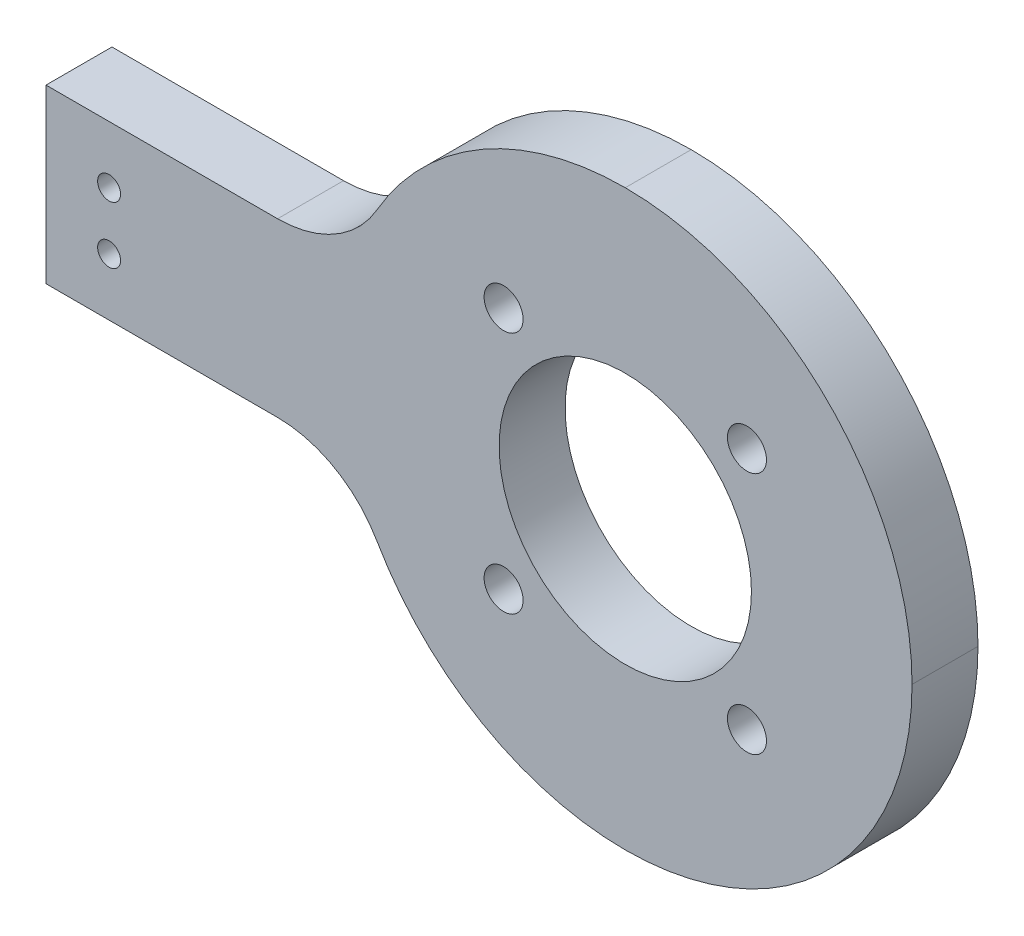
ISO-10303-21;
HEADER;
FILE_DESCRIPTION(('STEP AP214'),'2;1');
FILE_NAME('part.step','',(''),(''),'','','');
FILE_SCHEMA(('AUTOMOTIVE_DESIGN { 1 0 10303 214 1 1 1 1 }'));
ENDSEC;
DATA;
#1=APPLICATION_CONTEXT('core data for automotive mechanical design processes');
#2=APPLICATION_PROTOCOL_DEFINITION('international standard','automotive_design',2000,#1);
#3=PRODUCT_CONTEXT('',#1,'mechanical');
#4=PRODUCT('Part','Part','',(#3));
#5=PRODUCT_RELATED_PRODUCT_CATEGORY('part','',(#4));
#6=PRODUCT_DEFINITION_FORMATION('','',#4);
#7=PRODUCT_DEFINITION_CONTEXT('part definition',#1,'design');
#8=PRODUCT_DEFINITION('design','',#6,#7);
#9=PRODUCT_DEFINITION_SHAPE('','',#8);
#10=(LENGTH_UNIT() NAMED_UNIT(*) SI_UNIT(.MILLI.,.METRE.));
#11=(NAMED_UNIT(*) PLANE_ANGLE_UNIT() SI_UNIT($,.RADIAN.));
#12=(NAMED_UNIT(*) SI_UNIT($,.STERADIAN.) SOLID_ANGLE_UNIT());
#13=UNCERTAINTY_MEASURE_WITH_UNIT(LENGTH_MEASURE(1.E-05),#10,'distance_accuracy_value','');
#14=(GEOMETRIC_REPRESENTATION_CONTEXT(3) GLOBAL_UNCERTAINTY_ASSIGNED_CONTEXT((#13)) GLOBAL_UNIT_ASSIGNED_CONTEXT((#10,
#11,#12)) REPRESENTATION_CONTEXT('',''));
#15=CARTESIAN_POINT('',(0.,0.,0.));
#16=DIRECTION('',(0.,0.,1.));
#17=DIRECTION('',(1.,0.,0.));
#18=AXIS2_PLACEMENT_3D('',#15,#16,#17);
#19=CARTESIAN_POINT('',(0.,50.,0.));
#20=DIRECTION('',(0.,0.,-1.));
#21=DIRECTION('',(-1.,0.,0.));
#22=AXIS2_PLACEMENT_3D('',#19,#20,#21);
#23=PLANE('',#22);
#24=CARTESIAN_POINT('',(-70.,22.5,0.));
#25=DIRECTION('',(0.,0.,1.));
#26=DIRECTION('',(1.,0.,0.));
#27=AXIS2_PLACEMENT_3D('',#24,#25,#26);
#28=CIRCLE('',#27,0.999999999999998);
#29=CARTESIAN_POINT('',(-69.,22.5,0.));
#30=VERTEX_POINT('',#29);
#31=EDGE_CURVE('E282',#30,#30,#28,.T.);
#32=ORIENTED_EDGE('',*,*,#31,.F.);
#33=EDGE_LOOP('',(#32));
#34=FACE_BOUND('',#33,.T.);
#35=CARTESIAN_POINT('',(-70.,27.5,0.));
#36=DIRECTION('',(0.,0.,1.));
#37=DIRECTION('',(1.,0.,0.));
#38=AXIS2_PLACEMENT_3D('',#35,#36,#37);
#39=CIRCLE('',#38,0.999999999999998);
#40=CARTESIAN_POINT('',(-69.,27.5,0.));
#41=VERTEX_POINT('',#40);
#42=EDGE_CURVE('E273',#41,#41,#39,.T.);
#43=ORIENTED_EDGE('',*,*,#42,.F.);
#44=EDGE_LOOP('',(#43));
#45=FACE_BOUND('',#44,.T.);
#46=CARTESIAN_POINT('',(-35.6066017177982,35.6066017177983,0.));
#47=DIRECTION('',(0.,0.,1.));
#48=DIRECTION('',(1.,0.,0.));
#49=AXIS2_PLACEMENT_3D('',#46,#47,#48);
#50=CIRCLE('',#49,1.69999999999999);
#51=CARTESIAN_POINT('',(-33.9066017177982,35.6066017177983,0.));
#52=VERTEX_POINT('',#51);
#53=EDGE_CURVE('E148',#52,#52,#50,.T.);
#54=ORIENTED_EDGE('',*,*,#53,.F.);
#55=EDGE_LOOP('',(#54));
#56=FACE_BOUND('',#55,.T.);
#57=CARTESIAN_POINT('',(-14.3933982822018,35.6066017177982,0.));
#58=DIRECTION('',(0.,0.,1.));
#59=DIRECTION('',(1.,0.,0.));
#60=AXIS2_PLACEMENT_3D('',#57,#58,#59);
#61=CIRCLE('',#60,1.69999999999999);
#62=CARTESIAN_POINT('',(-12.6933982822018,35.6066017177982,0.));
#63=VERTEX_POINT('',#62);
#64=EDGE_CURVE('E157',#63,#63,#61,.T.);
#65=ORIENTED_EDGE('',*,*,#64,.F.);
#66=EDGE_LOOP('',(#65));
#67=FACE_BOUND('',#66,.T.);
#68=CARTESIAN_POINT('',(-14.3933982822018,14.3933982822017,0.));
#69=DIRECTION('',(0.,0.,1.));
#70=DIRECTION('',(1.,0.,0.));
#71=AXIS2_PLACEMENT_3D('',#68,#69,#70);
#72=CIRCLE('',#71,1.69999999999999);
#73=CARTESIAN_POINT('',(-12.6933982822018,14.3933982822017,0.));
#74=VERTEX_POINT('',#73);
#75=EDGE_CURVE('E165',#74,#74,#72,.T.);
#76=ORIENTED_EDGE('',*,*,#75,.F.);
#77=EDGE_LOOP('',(#76));
#78=FACE_BOUND('',#77,.T.);
#79=CARTESIAN_POINT('',(-35.6066017177982,14.3933982822018,0.));
#80=DIRECTION('',(0.,0.,1.));
#81=DIRECTION('',(1.,0.,0.));
#82=AXIS2_PLACEMENT_3D('',#79,#80,#81);
#83=CIRCLE('',#82,1.69999999999999);
#84=CARTESIAN_POINT('',(-33.9066017177982,14.3933982822018,0.));
#85=VERTEX_POINT('',#84);
#86=EDGE_CURVE('E173',#85,#85,#83,.T.);
#87=ORIENTED_EDGE('',*,*,#86,.F.);
#88=EDGE_LOOP('',(#87));
#89=FACE_BOUND('',#88,.T.);
#90=CARTESIAN_POINT('',(-25.,25.,0.));
#91=DIRECTION('',(0.,0.,1.));
#92=DIRECTION('',(1.,0.,0.));
#93=AXIS2_PLACEMENT_3D('',#90,#91,#92);
#94=CIRCLE('',#93,11.);
#95=CARTESIAN_POINT('',(-14.,25.,0.));
#96=VERTEX_POINT('',#95);
#97=EDGE_CURVE('E181',#96,#96,#94,.T.);
#98=ORIENTED_EDGE('',*,*,#97,.F.);
#99=EDGE_LOOP('',(#98));
#100=FACE_BOUND('',#99,.T.);
#101=DIRECTION('',(1.,0.,0.));
#102=VECTOR('',#101,1.);
#103=CARTESIAN_POINT('',(-100.,32.5,0.));
#104=LINE('',#103,#102);
#105=CARTESIAN_POINT('',(-75.5,32.5,0.));
#106=VERTEX_POINT('',#105);
#107=CARTESIAN_POINT('',(-55.3108891324554,32.5,0.));
#108=VERTEX_POINT('',#107);
#109=EDGE_CURVE('E66',#106,#108,#104,.T.);
#110=ORIENTED_EDGE('',*,*,#109,.F.);
#111=DIRECTION('',(0.,1.,0.));
#112=VECTOR('',#111,1.);
#113=CARTESIAN_POINT('',(-75.5,32.5,0.));
#114=LINE('',#113,#112);
#115=CARTESIAN_POINT('',(-75.5,17.5,0.));
#116=VERTEX_POINT('',#115);
#117=EDGE_CURVE('E59',#116,#106,#114,.T.);
#118=ORIENTED_EDGE('',*,*,#117,.F.);
#119=DIRECTION('',(-1.,0.,0.));
#120=VECTOR('',#119,1.);
#121=CARTESIAN_POINT('',(-100.,17.5,0.));
#122=LINE('',#121,#120);
#123=CARTESIAN_POINT('',(-55.3108891324554,17.5,0.));
#124=VERTEX_POINT('',#123);
#125=EDGE_CURVE('E124',#124,#116,#122,.T.);
#126=ORIENTED_EDGE('',*,*,#125,.F.);
#127=CARTESIAN_POINT('',(-55.3108891324554,7.5,0.));
#128=DIRECTION('',(0.,0.,-1.));
#129=DIRECTION('',(-1.,0.,0.));
#130=AXIS2_PLACEMENT_3D('',#127,#128,#129);
#131=CIRCLE('',#130,10.);
#132=CARTESIAN_POINT('',(-46.650635094611,12.5,0.));
#133=VERTEX_POINT('',#132);
#134=EDGE_CURVE('E219',#124,#133,#131,.T.);
#135=ORIENTED_EDGE('',*,*,#134,.T.);
#136=CARTESIAN_POINT('',(-25.,25.,0.));
#137=DIRECTION('',(0.,0.,-1.));
#138=DIRECTION('',(-1.,0.,0.));
#139=AXIS2_PLACEMENT_3D('',#136,#137,#138);
#140=CIRCLE('',#139,25.);
#141=CARTESIAN_POINT('',(-25.,0.,0.));
#142=VERTEX_POINT('',#141);
#143=EDGE_CURVE('E133',#142,#133,#140,.T.);
#144=ORIENTED_EDGE('',*,*,#143,.F.);
#145=CARTESIAN_POINT('',(-25.,25.,0.));
#146=DIRECTION('',(0.,0.,-1.));
#147=DIRECTION('',(-1.,0.,0.));
#148=AXIS2_PLACEMENT_3D('',#145,#146,#147);
#149=CIRCLE('',#148,25.);
#150=CARTESIAN_POINT('',(0.,25.,0.));
#151=VERTEX_POINT('',#150);
#152=EDGE_CURVE('E200',#142,#151,#149,.F.);
#153=ORIENTED_EDGE('',*,*,#152,.T.);
#154=CARTESIAN_POINT('',(-25.,25.,0.));
#155=DIRECTION('',(0.,0.,-1.));
#156=DIRECTION('',(-1.,0.,0.));
#157=AXIS2_PLACEMENT_3D('',#154,#155,#156);
#158=CIRCLE('',#157,25.);
#159=CARTESIAN_POINT('',(-25.,50.,0.));
#160=VERTEX_POINT('',#159);
#161=EDGE_CURVE('E196',#151,#160,#158,.F.);
#162=ORIENTED_EDGE('',*,*,#161,.T.);
#163=CARTESIAN_POINT('',(-25.,25.,0.));
#164=DIRECTION('',(0.,0.,-1.));
#165=DIRECTION('',(1.,0.,0.));
#166=AXIS2_PLACEMENT_3D('',#163,#164,#165);
#167=CIRCLE('',#166,25.);
#168=CARTESIAN_POINT('',(-46.650635094611,37.5,0.));
#169=VERTEX_POINT('',#168);
#170=EDGE_CURVE('E228',#169,#160,#167,.T.);
#171=ORIENTED_EDGE('',*,*,#170,.F.);
#172=CARTESIAN_POINT('',(-55.3108891324554,42.5,0.));
#173=DIRECTION('',(0.,0.,-1.));
#174=DIRECTION('',(-1.,0.,0.));
#175=AXIS2_PLACEMENT_3D('',#172,#173,#174);
#176=CIRCLE('',#175,10.);
#177=EDGE_CURVE('E52',#169,#108,#176,.T.);
#178=ORIENTED_EDGE('',*,*,#177,.T.);
#179=EDGE_LOOP('',(#110,#118,#126,#135,#144,#153,#162,#171,#178));
#180=FACE_BOUND('',#179,.T.);
#181=ADVANCED_FACE('F43',(#34,#45,#56,#67,#78,#89,#100,#180),#23,.F.);
#182=CARTESIAN_POINT('',(-100.,50.,-5.75));
#183=DIRECTION('',(0.,0.,1.));
#184=DIRECTION('',(1.,0.,0.));
#185=AXIS2_PLACEMENT_3D('',#182,#183,#184);
#186=PLANE('',#185);
#187=CARTESIAN_POINT('',(-70.,22.5,-5.75));
#188=DIRECTION('',(0.,0.,1.));
#189=DIRECTION('',(1.,0.,0.));
#190=AXIS2_PLACEMENT_3D('',#187,#188,#189);
#191=CIRCLE('',#190,0.999999999999998);
#192=CARTESIAN_POINT('',(-69.,22.5,-5.75));
#193=VERTEX_POINT('',#192);
#194=EDGE_CURVE('E276',#193,#193,#191,.F.);
#195=ORIENTED_EDGE('',*,*,#194,.F.);
#196=EDGE_LOOP('',(#195));
#197=FACE_BOUND('',#196,.T.);
#198=CARTESIAN_POINT('',(-70.,27.5,-5.75));
#199=DIRECTION('',(0.,0.,1.));
#200=DIRECTION('',(1.,0.,0.));
#201=AXIS2_PLACEMENT_3D('',#198,#199,#200);
#202=CIRCLE('',#201,0.999999999999998);
#203=CARTESIAN_POINT('',(-69.,27.5,-5.75));
#204=VERTEX_POINT('',#203);
#205=EDGE_CURVE('E206',#204,#204,#202,.F.);
#206=ORIENTED_EDGE('',*,*,#205,.F.);
#207=EDGE_LOOP('',(#206));
#208=FACE_BOUND('',#207,.T.);
#209=CARTESIAN_POINT('',(-35.6066017177982,35.6066017177983,-5.75));
#210=DIRECTION('',(0.,0.,1.));
#211=DIRECTION('',(1.,0.,0.));
#212=AXIS2_PLACEMENT_3D('',#209,#210,#211);
#213=CIRCLE('',#212,1.7);
#214=CARTESIAN_POINT('',(-33.9066017177982,35.6066017177983,-5.75));
#215=VERTEX_POINT('',#214);
#216=EDGE_CURVE('E152',#215,#215,#213,.T.);
#217=ORIENTED_EDGE('',*,*,#216,.T.);
#218=EDGE_LOOP('',(#217));
#219=FACE_BOUND('',#218,.T.);
#220=CARTESIAN_POINT('',(-14.3933982822018,35.6066017177982,-5.75));
#221=DIRECTION('',(0.,0.,1.));
#222=DIRECTION('',(1.,0.,0.));
#223=AXIS2_PLACEMENT_3D('',#220,#221,#222);
#224=CIRCLE('',#223,1.7);
#225=CARTESIAN_POINT('',(-12.6933982822018,35.6066017177982,-5.75));
#226=VERTEX_POINT('',#225);
#227=EDGE_CURVE('E161',#226,#226,#224,.T.);
#228=ORIENTED_EDGE('',*,*,#227,.T.);
#229=EDGE_LOOP('',(#228));
#230=FACE_BOUND('',#229,.T.);
#231=CARTESIAN_POINT('',(-14.3933982822018,14.3933982822017,-5.75));
#232=DIRECTION('',(0.,0.,1.));
#233=DIRECTION('',(1.,0.,0.));
#234=AXIS2_PLACEMENT_3D('',#231,#232,#233);
#235=CIRCLE('',#234,1.7);
#236=CARTESIAN_POINT('',(-12.6933982822018,14.3933982822017,-5.75));
#237=VERTEX_POINT('',#236);
#238=EDGE_CURVE('E169',#237,#237,#235,.T.);
#239=ORIENTED_EDGE('',*,*,#238,.T.);
#240=EDGE_LOOP('',(#239));
#241=FACE_BOUND('',#240,.T.);
#242=CARTESIAN_POINT('',(-35.6066017177982,14.3933982822018,-5.75));
#243=DIRECTION('',(0.,0.,1.));
#244=DIRECTION('',(1.,0.,0.));
#245=AXIS2_PLACEMENT_3D('',#242,#243,#244);
#246=CIRCLE('',#245,1.7);
#247=CARTESIAN_POINT('',(-33.9066017177982,14.3933982822018,-5.75));
#248=VERTEX_POINT('',#247);
#249=EDGE_CURVE('E177',#248,#248,#246,.T.);
#250=ORIENTED_EDGE('',*,*,#249,.T.);
#251=EDGE_LOOP('',(#250));
#252=FACE_BOUND('',#251,.T.);
#253=CARTESIAN_POINT('',(-25.,25.,-5.75));
#254=DIRECTION('',(0.,0.,1.));
#255=DIRECTION('',(1.,0.,0.));
#256=AXIS2_PLACEMENT_3D('',#253,#254,#255);
#257=CIRCLE('',#256,11.);
#258=CARTESIAN_POINT('',(-14.,25.,-5.75));
#259=VERTEX_POINT('',#258);
#260=EDGE_CURVE('E182',#259,#259,#257,.T.);
#261=ORIENTED_EDGE('',*,*,#260,.T.);
#262=EDGE_LOOP('',(#261));
#263=FACE_BOUND('',#262,.T.);
#264=DIRECTION('',(1.,0.,0.));
#265=VECTOR('',#264,1.);
#266=CARTESIAN_POINT('',(-100.,17.5,-5.75000000000001));
#267=LINE('',#266,#265);
#268=CARTESIAN_POINT('',(-75.5,17.5,-5.75));
#269=VERTEX_POINT('',#268);
#270=CARTESIAN_POINT('',(-55.3108891324554,17.5,-5.75000000000001));
#271=VERTEX_POINT('',#270);
#272=EDGE_CURVE('E145',#269,#271,#267,.T.);
#273=ORIENTED_EDGE('',*,*,#272,.F.);
#274=DIRECTION('',(0.,-1.,0.));
#275=VECTOR('',#274,1.);
#276=CARTESIAN_POINT('',(-75.5,32.5,-5.75));
#277=LINE('',#276,#275);
#278=CARTESIAN_POINT('',(-75.5,32.5,-5.75));
#279=VERTEX_POINT('',#278);
#280=EDGE_CURVE('E115',#279,#269,#277,.T.);
#281=ORIENTED_EDGE('',*,*,#280,.F.);
#282=DIRECTION('',(-1.,0.,0.));
#283=VECTOR('',#282,1.);
#284=CARTESIAN_POINT('',(-100.,32.5,-5.75000000000001));
#285=LINE('',#284,#283);
#286=CARTESIAN_POINT('',(-55.3108891324554,32.5,-5.75000000000001));
#287=VERTEX_POINT('',#286);
#288=EDGE_CURVE('E153',#287,#279,#285,.T.);
#289=ORIENTED_EDGE('',*,*,#288,.F.);
#290=CARTESIAN_POINT('',(-55.3108891324554,42.5,-5.75000000000001));
#291=DIRECTION('',(0.,0.,1.));
#292=DIRECTION('',(1.,0.,0.));
#293=AXIS2_PLACEMENT_3D('',#290,#291,#292);
#294=CIRCLE('',#293,10.);
#295=CARTESIAN_POINT('',(-46.650635094611,37.5,-5.75000000000001));
#296=VERTEX_POINT('',#295);
#297=EDGE_CURVE('E11',#287,#296,#294,.T.);
#298=ORIENTED_EDGE('',*,*,#297,.T.);
#299=CARTESIAN_POINT('',(-25.,25.,-5.75000000000001));
#300=DIRECTION('',(0.,0.,1.));
#301=DIRECTION('',(1.,0.,0.));
#302=AXIS2_PLACEMENT_3D('',#299,#300,#301);
#303=CIRCLE('',#302,25.);
#304=CARTESIAN_POINT('',(-25.,50.,-5.75000000000001));
#305=VERTEX_POINT('',#304);
#306=EDGE_CURVE('E240',#305,#296,#303,.T.);
#307=ORIENTED_EDGE('',*,*,#306,.F.);
#308=CARTESIAN_POINT('',(-25.,25.,-5.75));
#309=DIRECTION('',(0.,0.,1.));
#310=DIRECTION('',(1.,0.,0.));
#311=AXIS2_PLACEMENT_3D('',#308,#309,#310);
#312=CIRCLE('',#311,25.);
#313=CARTESIAN_POINT('',(0.,25.,-5.75));
#314=VERTEX_POINT('',#313);
#315=EDGE_CURVE('E186',#305,#314,#312,.F.);
#316=ORIENTED_EDGE('',*,*,#315,.T.);
#317=CARTESIAN_POINT('',(-25.,25.,-5.75));
#318=DIRECTION('',(0.,0.,1.));
#319=DIRECTION('',(1.,0.,0.));
#320=AXIS2_PLACEMENT_3D('',#317,#318,#319);
#321=CIRCLE('',#320,25.);
#322=CARTESIAN_POINT('',(-25.,0.,-5.75));
#323=VERTEX_POINT('',#322);
#324=EDGE_CURVE('E192',#314,#323,#321,.F.);
#325=ORIENTED_EDGE('',*,*,#324,.T.);
#326=CARTESIAN_POINT('',(-25.,25.,-5.75000000000001));
#327=DIRECTION('',(0.,0.,1.));
#328=DIRECTION('',(1.,0.,0.));
#329=AXIS2_PLACEMENT_3D('',#326,#327,#328);
#330=CIRCLE('',#329,25.);
#331=CARTESIAN_POINT('',(-46.650635094611,12.5,-5.75000000000001));
#332=VERTEX_POINT('',#331);
#333=EDGE_CURVE('E138',#332,#323,#330,.T.);
#334=ORIENTED_EDGE('',*,*,#333,.F.);
#335=CARTESIAN_POINT('',(-55.3108891324554,7.5,-5.75000000000001));
#336=DIRECTION('',(0.,0.,1.));
#337=DIRECTION('',(1.,0.,0.));
#338=AXIS2_PLACEMENT_3D('',#335,#336,#337);
#339=CIRCLE('',#338,10.);
#340=EDGE_CURVE('E222',#332,#271,#339,.T.);
#341=ORIENTED_EDGE('',*,*,#340,.T.);
#342=EDGE_LOOP('',(#273,#281,#289,#298,#307,#316,#325,#334,#341));
#343=FACE_BOUND('',#342,.T.);
#344=ADVANCED_FACE('F236',(#197,#208,#219,#230,#241,#252,#263,#343),#186,.F.);
#345=CARTESIAN_POINT('',(-25.,25.,-5.75));
#346=DIRECTION('',(0.,0.,1.));
#347=DIRECTION('',(1.,0.,0.));
#348=AXIS2_PLACEMENT_3D('',#345,#346,#347);
#349=CYLINDRICAL_SURFACE('',#348,11.);
#350=ORIENTED_EDGE('',*,*,#260,.F.);
#351=EDGE_LOOP('',(#350));
#352=FACE_BOUND('',#351,.T.);
#353=ORIENTED_EDGE('',*,*,#97,.T.);
#354=EDGE_LOOP('',(#353));
#355=FACE_BOUND('',#354,.T.);
#356=ADVANCED_FACE('F307',(#352,#355),#349,.F.);
#357=CARTESIAN_POINT('',(-35.6066017177982,14.3933982822018,0.));
#358=DIRECTION('',(0.,0.,1.));
#359=DIRECTION('',(1.,0.,0.));
#360=AXIS2_PLACEMENT_3D('',#357,#358,#359);
#361=CYLINDRICAL_SURFACE('',#360,1.69999999999999);
#362=ORIENTED_EDGE('',*,*,#249,.F.);
#363=EDGE_LOOP('',(#362));
#364=FACE_BOUND('',#363,.T.);
#365=ORIENTED_EDGE('',*,*,#86,.T.);
#366=EDGE_LOOP('',(#365));
#367=FACE_BOUND('',#366,.T.);
#368=ADVANCED_FACE('F309',(#364,#367),#361,.F.);
#369=CARTESIAN_POINT('',(-14.3933982822018,14.3933982822017,0.));
#370=DIRECTION('',(0.,0.,1.));
#371=DIRECTION('',(1.,0.,0.));
#372=AXIS2_PLACEMENT_3D('',#369,#370,#371);
#373=CYLINDRICAL_SURFACE('',#372,1.69999999999999);
#374=ORIENTED_EDGE('',*,*,#238,.F.);
#375=EDGE_LOOP('',(#374));
#376=FACE_BOUND('',#375,.T.);
#377=ORIENTED_EDGE('',*,*,#75,.T.);
#378=EDGE_LOOP('',(#377));
#379=FACE_BOUND('',#378,.T.);
#380=ADVANCED_FACE('F316',(#376,#379),#373,.F.);
#381=CARTESIAN_POINT('',(-14.3933982822018,35.6066017177982,0.));
#382=DIRECTION('',(0.,0.,1.));
#383=DIRECTION('',(1.,0.,0.));
#384=AXIS2_PLACEMENT_3D('',#381,#382,#383);
#385=CYLINDRICAL_SURFACE('',#384,1.69999999999999);
#386=ORIENTED_EDGE('',*,*,#227,.F.);
#387=EDGE_LOOP('',(#386));
#388=FACE_BOUND('',#387,.T.);
#389=ORIENTED_EDGE('',*,*,#64,.T.);
#390=EDGE_LOOP('',(#389));
#391=FACE_BOUND('',#390,.T.);
#392=ADVANCED_FACE('F357',(#388,#391),#385,.F.);
#393=CARTESIAN_POINT('',(-35.6066017177982,35.6066017177983,0.));
#394=DIRECTION('',(0.,0.,1.));
#395=DIRECTION('',(1.,0.,0.));
#396=AXIS2_PLACEMENT_3D('',#393,#394,#395);
#397=CYLINDRICAL_SURFACE('',#396,1.69999999999999);
#398=ORIENTED_EDGE('',*,*,#216,.F.);
#399=EDGE_LOOP('',(#398));
#400=FACE_BOUND('',#399,.T.);
#401=ORIENTED_EDGE('',*,*,#53,.T.);
#402=EDGE_LOOP('',(#401));
#403=FACE_BOUND('',#402,.T.);
#404=ADVANCED_FACE('F354',(#400,#403),#397,.F.);
#405=CARTESIAN_POINT('',(-25.,25.,-82.7646090037468));
#406=DIRECTION('',(0.,0.,1.));
#407=DIRECTION('',(1.,0.,0.));
#408=AXIS2_PLACEMENT_3D('',#405,#406,#407);
#409=CYLINDRICAL_SURFACE('',#408,25.);
#410=ORIENTED_EDGE('',*,*,#143,.T.);
#411=DIRECTION('',(0.,0.,1.));
#412=VECTOR('',#411,1.);
#413=CARTESIAN_POINT('',(-46.650635094611,12.5,-82.7646090037468));
#414=LINE('',#413,#412);
#415=EDGE_CURVE('E209',#133,#332,#414,.F.);
#416=ORIENTED_EDGE('',*,*,#415,.T.);
#417=ORIENTED_EDGE('',*,*,#333,.T.);
#418=DIRECTION('',(0.,0.,1.));
#419=VECTOR('',#418,1.);
#420=CARTESIAN_POINT('',(-25.,0.,-82.7646090037468));
#421=LINE('',#420,#419);
#422=EDGE_CURVE('E132',#323,#142,#421,.T.);
#423=ORIENTED_EDGE('',*,*,#422,.T.);
#424=EDGE_LOOP('',(#410,#416,#417,#423));
#425=FACE_BOUND('',#424,.T.);
#426=ADVANCED_FACE('F250',(#425),#409,.T.);
#427=CARTESIAN_POINT('',(-100.,17.5,-82.7646090037468));
#428=DIRECTION('',(0.,1.,0.));
#429=DIRECTION('',(-1.,0.,0.));
#430=AXIS2_PLACEMENT_3D('',#427,#428,#429);
#431=PLANE('',#430);
#432=ORIENTED_EDGE('',*,*,#125,.T.);
#433=DIRECTION('',(0.,0.,1.));
#434=VECTOR('',#433,1.);
#435=CARTESIAN_POINT('',(-75.5,17.5,-34.4771648444464));
#436=LINE('',#435,#434);
#437=EDGE_CURVE('E112',#269,#116,#436,.T.);
#438=ORIENTED_EDGE('',*,*,#437,.F.);
#439=ORIENTED_EDGE('',*,*,#272,.T.);
#440=DIRECTION('',(0.,0.,-1.));
#441=VECTOR('',#440,1.);
#442=CARTESIAN_POINT('',(-55.3108891324554,17.5,0.));
#443=LINE('',#442,#441);
#444=EDGE_CURVE('E130',#271,#124,#443,.F.);
#445=ORIENTED_EDGE('',*,*,#444,.T.);
#446=EDGE_LOOP('',(#432,#438,#439,#445));
#447=FACE_BOUND('',#446,.T.);
#448=ADVANCED_FACE('F128',(#447),#431,.F.);
#449=CARTESIAN_POINT('',(-25.,25.,-82.7646090037468));
#450=DIRECTION('',(0.,0.,1.));
#451=DIRECTION('',(1.,0.,0.));
#452=AXIS2_PLACEMENT_3D('',#449,#450,#451);
#453=CYLINDRICAL_SURFACE('',#452,25.);
#454=ORIENTED_EDGE('',*,*,#306,.T.);
#455=DIRECTION('',(0.,0.,1.));
#456=VECTOR('',#455,1.);
#457=CARTESIAN_POINT('',(-46.650635094611,37.5,-82.7646090037468));
#458=LINE('',#457,#456);
#459=EDGE_CURVE('E212',#296,#169,#458,.T.);
#460=ORIENTED_EDGE('',*,*,#459,.T.);
#461=ORIENTED_EDGE('',*,*,#170,.T.);
#462=DIRECTION('',(0.,0.,1.));
#463=VECTOR('',#462,1.);
#464=CARTESIAN_POINT('',(-25.,50.,-82.7646090037468));
#465=LINE('',#464,#463);
#466=EDGE_CURVE('E243',#305,#160,#465,.T.);
#467=ORIENTED_EDGE('',*,*,#466,.F.);
#468=EDGE_LOOP('',(#454,#460,#461,#467));
#469=FACE_BOUND('',#468,.T.);
#470=ADVANCED_FACE('F345',(#469),#453,.T.);
#471=CARTESIAN_POINT('',(-100.,32.5,-82.7646090037468));
#472=DIRECTION('',(0.,-1.,0.));
#473=DIRECTION('',(0.,0.,-1.));
#474=AXIS2_PLACEMENT_3D('',#471,#472,#473);
#475=PLANE('',#474);
#476=ORIENTED_EDGE('',*,*,#288,.T.);
#477=DIRECTION('',(0.,0.,1.));
#478=VECTOR('',#477,1.);
#479=CARTESIAN_POINT('',(-75.5,32.5,-34.4771648444464));
#480=LINE('',#479,#478);
#481=EDGE_CURVE('E120',#279,#106,#480,.T.);
#482=ORIENTED_EDGE('',*,*,#481,.T.);
#483=ORIENTED_EDGE('',*,*,#109,.T.);
#484=DIRECTION('',(0.,0.,-1.));
#485=VECTOR('',#484,1.);
#486=CARTESIAN_POINT('',(-55.3108891324554,32.5,-5.75000000000001));
#487=LINE('',#486,#485);
#488=EDGE_CURVE('E216',#108,#287,#487,.T.);
#489=ORIENTED_EDGE('',*,*,#488,.T.);
#490=EDGE_LOOP('',(#476,#482,#483,#489));
#491=FACE_BOUND('',#490,.T.);
#492=ADVANCED_FACE('F234',(#491),#475,.F.);
#493=CARTESIAN_POINT('',(-25.,25.,0.));
#494=DIRECTION('',(0.,0.,-1.));
#495=DIRECTION('',(-1.,0.,0.));
#496=AXIS2_PLACEMENT_3D('',#493,#494,#495);
#497=CYLINDRICAL_SURFACE('',#496,25.);
#498=ORIENTED_EDGE('',*,*,#466,.T.);
#499=ORIENTED_EDGE('',*,*,#161,.F.);
#500=DIRECTION('',(0.,0.,-1.));
#501=VECTOR('',#500,1.);
#502=CARTESIAN_POINT('',(0.,25.,-5.75));
#503=LINE('',#502,#501);
#504=EDGE_CURVE('E141',#314,#151,#503,.F.);
#505=ORIENTED_EDGE('',*,*,#504,.F.);
#506=ORIENTED_EDGE('',*,*,#315,.F.);
#507=EDGE_LOOP('',(#498,#499,#505,#506));
#508=FACE_BOUND('',#507,.T.);
#509=ADVANCED_FACE('F263',(#508),#497,.T.);
#510=CARTESIAN_POINT('',(-25.,25.,-5.75));
#511=DIRECTION('',(0.,0.,1.));
#512=DIRECTION('',(1.,0.,0.));
#513=AXIS2_PLACEMENT_3D('',#510,#511,#512);
#514=CYLINDRICAL_SURFACE('',#513,25.);
#515=ORIENTED_EDGE('',*,*,#152,.F.);
#516=ORIENTED_EDGE('',*,*,#422,.F.);
#517=ORIENTED_EDGE('',*,*,#324,.F.);
#518=ORIENTED_EDGE('',*,*,#504,.T.);
#519=EDGE_LOOP('',(#515,#516,#517,#518));
#520=FACE_BOUND('',#519,.T.);
#521=ADVANCED_FACE('F259',(#520),#514,.T.);
#522=CARTESIAN_POINT('',(-55.3108891324554,7.5,-82.7646090037468));
#523=DIRECTION('',(0.,0.,1.));
#524=DIRECTION('',(1.,0.,0.));
#525=AXIS2_PLACEMENT_3D('',#522,#523,#524);
#526=CYLINDRICAL_SURFACE('',#525,10.);
#527=ORIENTED_EDGE('',*,*,#340,.F.);
#528=ORIENTED_EDGE('',*,*,#415,.F.);
#529=ORIENTED_EDGE('',*,*,#134,.F.);
#530=ORIENTED_EDGE('',*,*,#444,.F.);
#531=EDGE_LOOP('',(#527,#528,#529,#530));
#532=FACE_BOUND('',#531,.T.);
#533=ADVANCED_FACE('F326',(#532),#526,.F.);
#534=CARTESIAN_POINT('',(-55.3108891324554,42.5,-82.7646090037468));
#535=DIRECTION('',(0.,0.,1.));
#536=DIRECTION('',(1.,0.,0.));
#537=AXIS2_PLACEMENT_3D('',#534,#535,#536);
#538=CYLINDRICAL_SURFACE('',#537,10.);
#539=ORIENTED_EDGE('',*,*,#297,.F.);
#540=ORIENTED_EDGE('',*,*,#488,.F.);
#541=ORIENTED_EDGE('',*,*,#177,.F.);
#542=ORIENTED_EDGE('',*,*,#459,.F.);
#543=EDGE_LOOP('',(#539,#540,#541,#542));
#544=FACE_BOUND('',#543,.T.);
#545=ADVANCED_FACE('F45',(#544),#538,.F.);
#546=CARTESIAN_POINT('',(-75.5,32.5,-34.4771648444464));
#547=DIRECTION('',(1.,0.,0.));
#548=DIRECTION('',(0.,0.,-1.));
#549=AXIS2_PLACEMENT_3D('',#546,#547,#548);
#550=PLANE('',#549);
#551=ORIENTED_EDGE('',*,*,#280,.T.);
#552=ORIENTED_EDGE('',*,*,#437,.T.);
#553=ORIENTED_EDGE('',*,*,#117,.T.);
#554=ORIENTED_EDGE('',*,*,#481,.F.);
#555=EDGE_LOOP('',(#551,#552,#553,#554));
#556=FACE_BOUND('',#555,.T.);
#557=ADVANCED_FACE('F113',(#556),#550,.F.);
#558=CARTESIAN_POINT('',(-70.,27.5,-34.4771648444464));
#559=DIRECTION('',(0.,0.,1.));
#560=DIRECTION('',(1.,0.,0.));
#561=AXIS2_PLACEMENT_3D('',#558,#559,#560);
#562=CYLINDRICAL_SURFACE('',#561,0.999999999999998);
#563=ORIENTED_EDGE('',*,*,#205,.T.);
#564=EDGE_LOOP('',(#563));
#565=FACE_BOUND('',#564,.T.);
#566=ORIENTED_EDGE('',*,*,#42,.T.);
#567=EDGE_LOOP('',(#566));
#568=FACE_BOUND('',#567,.T.);
#569=ADVANCED_FACE('F336',(#565,#568),#562,.F.);
#570=CARTESIAN_POINT('',(-70.,22.5,-34.4771648444464));
#571=DIRECTION('',(0.,0.,1.));
#572=DIRECTION('',(1.,0.,0.));
#573=AXIS2_PLACEMENT_3D('',#570,#571,#572);
#574=CYLINDRICAL_SURFACE('',#573,0.999999999999998);
#575=ORIENTED_EDGE('',*,*,#194,.T.);
#576=EDGE_LOOP('',(#575));
#577=FACE_BOUND('',#576,.T.);
#578=ORIENTED_EDGE('',*,*,#31,.T.);
#579=EDGE_LOOP('',(#578));
#580=FACE_BOUND('',#579,.T.);
#581=ADVANCED_FACE('F290',(#577,#580),#574,.F.);
#582=CLOSED_SHELL('',(#181,#344,#356,#368,#380,#392,#404,#426,#448,#470,#492,#509,#521,#533,
#545,#557,#569,#581));
#583=MANIFOLD_SOLID_BREP('B2',#582);
#584=ADVANCED_BREP_SHAPE_REPRESENTATION('',(#18,#583),#14);
#585=SHAPE_DEFINITION_REPRESENTATION(#9,#584);
ENDSEC;
END-ISO-10303-21;
